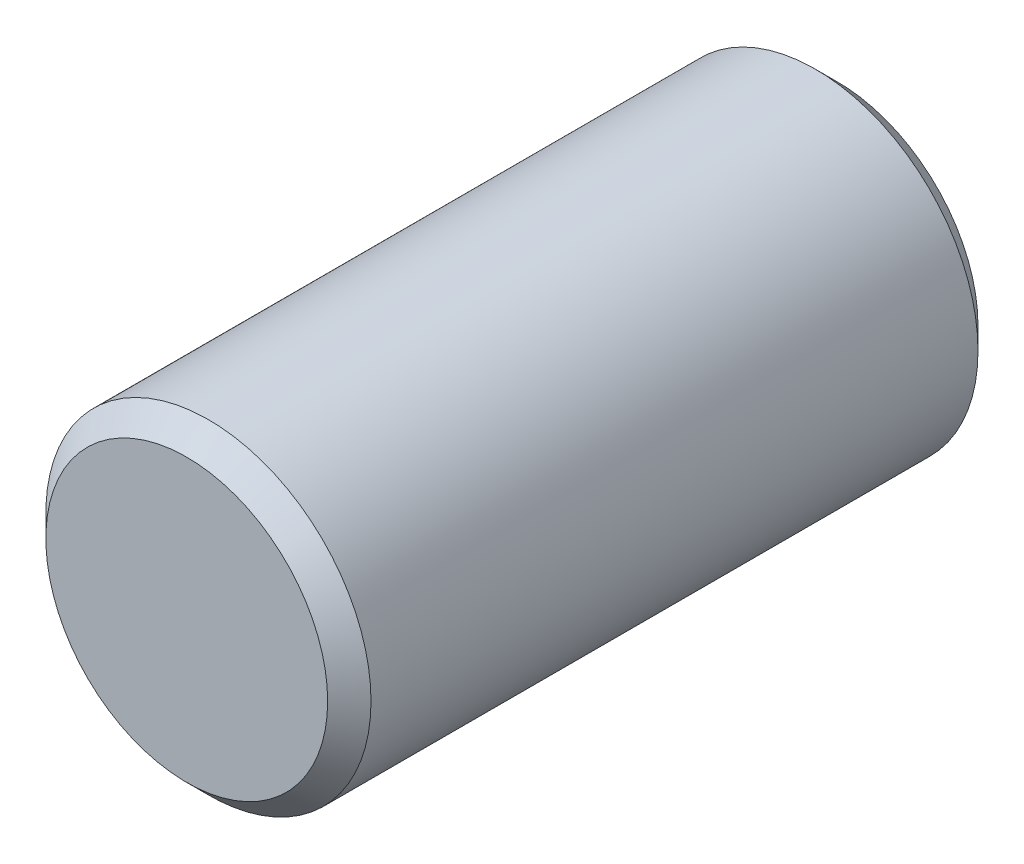
ISO-10303-21;
HEADER;
FILE_DESCRIPTION(('STEP AP214'),'2;1');
FILE_NAME('part.step','',(''),(''),'','','');
FILE_SCHEMA(('AUTOMOTIVE_DESIGN { 1 0 10303 214 1 1 1 1 }'));
ENDSEC;
DATA;
#1=APPLICATION_CONTEXT('core data for automotive mechanical design processes');
#2=APPLICATION_PROTOCOL_DEFINITION('international standard','automotive_design',2000,#1);
#3=PRODUCT_CONTEXT('',#1,'mechanical');
#4=PRODUCT('Part','Part','',(#3));
#5=PRODUCT_RELATED_PRODUCT_CATEGORY('part','',(#4));
#6=PRODUCT_DEFINITION_FORMATION('','',#4);
#7=PRODUCT_DEFINITION_CONTEXT('part definition',#1,'design');
#8=PRODUCT_DEFINITION('design','',#6,#7);
#9=PRODUCT_DEFINITION_SHAPE('','',#8);
#10=(LENGTH_UNIT() NAMED_UNIT(*) SI_UNIT(.MILLI.,.METRE.));
#11=(NAMED_UNIT(*) PLANE_ANGLE_UNIT() SI_UNIT($,.RADIAN.));
#12=(NAMED_UNIT(*) SI_UNIT($,.STERADIAN.) SOLID_ANGLE_UNIT());
#13=UNCERTAINTY_MEASURE_WITH_UNIT(LENGTH_MEASURE(1.E-05),#10,'distance_accuracy_value','');
#14=(GEOMETRIC_REPRESENTATION_CONTEXT(3) GLOBAL_UNCERTAINTY_ASSIGNED_CONTEXT((#13)) GLOBAL_UNIT_ASSIGNED_CONTEXT((#10,
#11,#12)) REPRESENTATION_CONTEXT('',''));
#15=CARTESIAN_POINT('',(0.,0.,0.));
#16=DIRECTION('',(0.,0.,1.));
#17=DIRECTION('',(1.,0.,0.));
#18=AXIS2_PLACEMENT_3D('',#15,#16,#17);
#19=CARTESIAN_POINT('',(0.,0.,0.75));
#20=DIRECTION('',(0.,0.,-1.));
#21=DIRECTION('',(-1.,0.,0.));
#22=AXIS2_PLACEMENT_3D('',#19,#20,#21);
#23=CYLINDRICAL_SURFACE('',#22,0.375);
#24=CARTESIAN_POINT('',(0.,0.,-0.7));
#25=DIRECTION('',(0.,0.,1.));
#26=DIRECTION('',(1.,0.,0.));
#27=AXIS2_PLACEMENT_3D('',#24,#25,#26);
#28=CIRCLE('',#27,0.375);
#29=CARTESIAN_POINT('',(0.375,0.,-0.7));
#30=VERTEX_POINT('',#29);
#31=EDGE_CURVE('E59',#30,#30,#28,.T.);
#32=ORIENTED_EDGE('',*,*,#31,.T.);
#33=EDGE_LOOP('',(#32));
#34=FACE_BOUND('',#33,.T.);
#35=CARTESIAN_POINT('',(0.,0.,0.7));
#36=DIRECTION('',(0.,0.,1.));
#37=DIRECTION('',(1.,0.,0.));
#38=AXIS2_PLACEMENT_3D('',#35,#36,#37);
#39=CIRCLE('',#38,0.375);
#40=CARTESIAN_POINT('',(0.375,0.,0.7));
#41=VERTEX_POINT('',#40);
#42=EDGE_CURVE('E64',#41,#41,#39,.F.);
#43=ORIENTED_EDGE('',*,*,#42,.T.);
#44=EDGE_LOOP('',(#43));
#45=FACE_BOUND('',#44,.T.);
#46=ADVANCED_FACE('F45',(#34,#45),#23,.T.);
#47=CARTESIAN_POINT('',(0.,0.,0.75));
#48=DIRECTION('',(0.,0.,1.));
#49=DIRECTION('',(1.,0.,0.));
#50=AXIS2_PLACEMENT_3D('',#47,#48,#49);
#51=PLANE('',#50);
#52=CARTESIAN_POINT('',(0.,0.,0.75));
#53=DIRECTION('',(0.,0.,1.));
#54=DIRECTION('',(1.,0.,0.));
#55=AXIS2_PLACEMENT_3D('',#52,#53,#54);
#56=CIRCLE('',#55,0.325);
#57=CARTESIAN_POINT('',(0.325,0.,0.75));
#58=VERTEX_POINT('',#57);
#59=EDGE_CURVE('E10',#58,#58,#56,.T.);
#60=ORIENTED_EDGE('',*,*,#59,.T.);
#61=EDGE_LOOP('',(#60));
#62=FACE_BOUND('',#61,.T.);
#63=ADVANCED_FACE('F81',(#62),#51,.T.);
#64=CARTESIAN_POINT('',(0.,0.,-0.75));
#65=DIRECTION('',(0.,0.,1.));
#66=DIRECTION('',(1.,0.,0.));
#67=AXIS2_PLACEMENT_3D('',#64,#65,#66);
#68=PLANE('',#67);
#69=CARTESIAN_POINT('',(0.,0.,-0.75));
#70=DIRECTION('',(0.,0.,1.));
#71=DIRECTION('',(1.,0.,0.));
#72=AXIS2_PLACEMENT_3D('',#69,#70,#71);
#73=CIRCLE('',#72,0.325);
#74=CARTESIAN_POINT('',(0.325,0.,-0.75));
#75=VERTEX_POINT('',#74);
#76=EDGE_CURVE('E54',#75,#75,#73,.F.);
#77=ORIENTED_EDGE('',*,*,#76,.T.);
#78=EDGE_LOOP('',(#77));
#79=FACE_BOUND('',#78,.T.);
#80=ADVANCED_FACE('F78',(#79),#68,.F.);
#81=CARTESIAN_POINT('',(0.,0.,-0.7));
#82=DIRECTION('',(0.,0.,1.));
#83=DIRECTION('',(1.,0.,0.));
#84=AXIS2_PLACEMENT_3D('',#81,#82,#83);
#85=CONICAL_SURFACE('',#84,0.375,0.78539816339745);
#86=ORIENTED_EDGE('',*,*,#76,.F.);
#87=EDGE_LOOP('',(#86));
#88=FACE_BOUND('',#87,.T.);
#89=ORIENTED_EDGE('',*,*,#31,.F.);
#90=EDGE_LOOP('',(#89));
#91=FACE_BOUND('',#90,.T.);
#92=ADVANCED_FACE('F74',(#88,#91),#85,.T.);
#93=CARTESIAN_POINT('',(0.,0.,0.75));
#94=DIRECTION('',(0.,0.,-1.));
#95=DIRECTION('',(-1.,0.,0.));
#96=AXIS2_PLACEMENT_3D('',#93,#94,#95);
#97=CONICAL_SURFACE('',#96,0.325,0.785398163397447);
#98=ORIENTED_EDGE('',*,*,#42,.F.);
#99=EDGE_LOOP('',(#98));
#100=FACE_BOUND('',#99,.T.);
#101=ORIENTED_EDGE('',*,*,#59,.F.);
#102=EDGE_LOOP('',(#101));
#103=FACE_BOUND('',#102,.T.);
#104=ADVANCED_FACE('F48',(#100,#103),#97,.T.);
#105=CLOSED_SHELL('',(#46,#63,#80,#92,#104));
#106=MANIFOLD_SOLID_BREP('B2',#105);
#107=ADVANCED_BREP_SHAPE_REPRESENTATION('',(#18,#106),#14);
#108=SHAPE_DEFINITION_REPRESENTATION(#9,#107);
ENDSEC;
END-ISO-10303-21;
